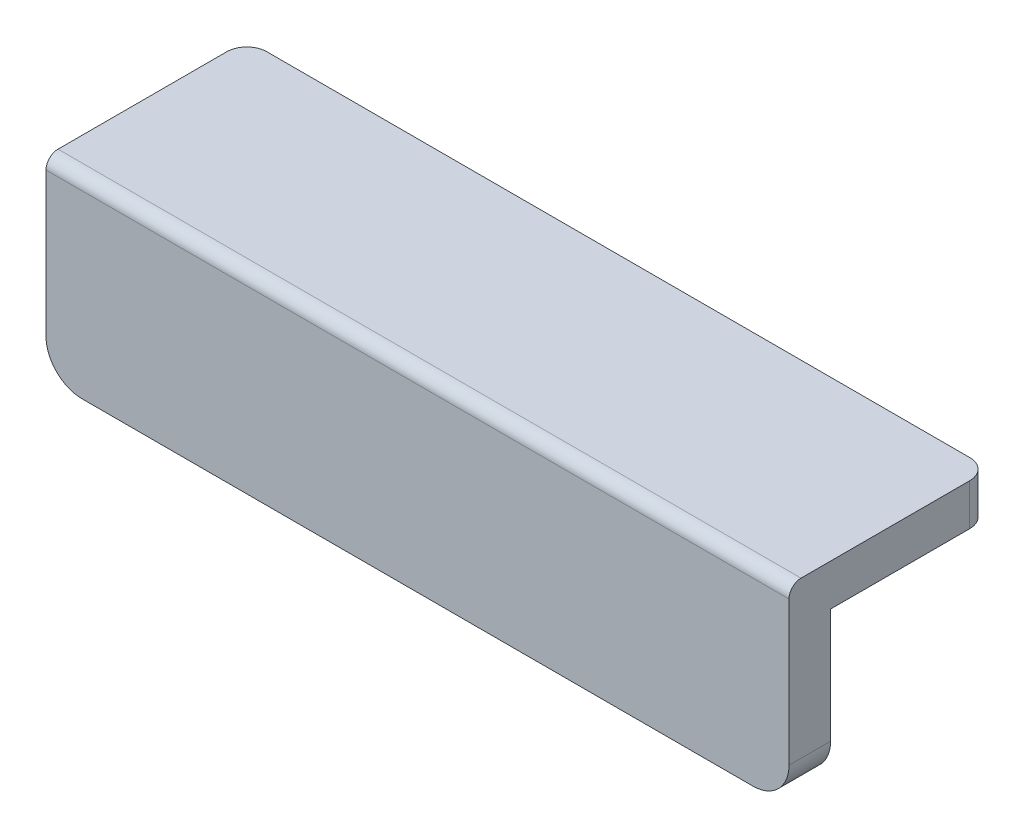
ISO-10303-21;
HEADER;
FILE_DESCRIPTION(('STEP AP214'),'2;1');
FILE_NAME('part.step','',(''),(''),'','','');
FILE_SCHEMA(('AUTOMOTIVE_DESIGN { 1 0 10303 214 1 1 1 1 }'));
ENDSEC;
DATA;
#1=APPLICATION_CONTEXT('core data for automotive mechanical design processes');
#2=APPLICATION_PROTOCOL_DEFINITION('international standard','automotive_design',2000,#1);
#3=PRODUCT_CONTEXT('',#1,'mechanical');
#4=PRODUCT('Part','Part','',(#3));
#5=PRODUCT_RELATED_PRODUCT_CATEGORY('part','',(#4));
#6=PRODUCT_DEFINITION_FORMATION('','',#4);
#7=PRODUCT_DEFINITION_CONTEXT('part definition',#1,'design');
#8=PRODUCT_DEFINITION('design','',#6,#7);
#9=PRODUCT_DEFINITION_SHAPE('','',#8);
#10=(LENGTH_UNIT() NAMED_UNIT(*) SI_UNIT(.MILLI.,.METRE.));
#11=(NAMED_UNIT(*) PLANE_ANGLE_UNIT() SI_UNIT($,.RADIAN.));
#12=(NAMED_UNIT(*) SI_UNIT($,.STERADIAN.) SOLID_ANGLE_UNIT());
#13=UNCERTAINTY_MEASURE_WITH_UNIT(LENGTH_MEASURE(1.E-05),#10,'distance_accuracy_value','');
#14=(GEOMETRIC_REPRESENTATION_CONTEXT(3) GLOBAL_UNCERTAINTY_ASSIGNED_CONTEXT((#13)) GLOBAL_UNIT_ASSIGNED_CONTEXT((#10,
#11,#12)) REPRESENTATION_CONTEXT('',''));
#15=CARTESIAN_POINT('',(0.,0.,0.));
#16=DIRECTION('',(0.,0.,1.));
#17=DIRECTION('',(1.,0.,0.));
#18=AXIS2_PLACEMENT_3D('',#15,#16,#17);
#19=CARTESIAN_POINT('',(44.45,-9.525,-20.2311));
#20=DIRECTION('',(0.,1.,0.));
#21=DIRECTION('',(0.,0.,1.));
#22=AXIS2_PLACEMENT_3D('',#19,#20,#21);
#23=CYLINDRICAL_SURFACE('',#22,2.54);
#24=DIRECTION('',(0.,1.,0.));
#25=VECTOR('',#24,1.);
#26=CARTESIAN_POINT('',(46.99,-9.525,-20.2311));
#27=LINE('',#26,#25);
#28=CARTESIAN_POINT('',(46.99,9.525,-20.2311));
#29=VERTEX_POINT('',#28);
#30=CARTESIAN_POINT('',(46.99,14.7828,-20.2311));
#31=VERTEX_POINT('',#30);
#32=EDGE_CURVE('E188',#29,#31,#27,.T.);
#33=ORIENTED_EDGE('',*,*,#32,.F.);
#34=CARTESIAN_POINT('',(44.45,9.525,-20.2311));
#35=DIRECTION('',(0.,-1.,0.));
#36=DIRECTION('',(0.,0.,-1.));
#37=AXIS2_PLACEMENT_3D('',#34,#35,#36);
#38=CIRCLE('',#37,2.54);
#39=CARTESIAN_POINT('',(44.45,9.525,-22.7711));
#40=VERTEX_POINT('',#39);
#41=EDGE_CURVE('E41',#40,#29,#38,.T.);
#42=ORIENTED_EDGE('',*,*,#41,.F.);
#43=DIRECTION('',(0.,1.,0.));
#44=VECTOR('',#43,1.);
#45=CARTESIAN_POINT('',(44.45,14.7828,-22.7711));
#46=LINE('',#45,#44);
#47=CARTESIAN_POINT('',(44.45,14.7828,-22.7711));
#48=VERTEX_POINT('',#47);
#49=EDGE_CURVE('E191',#48,#40,#46,.F.);
#50=ORIENTED_EDGE('',*,*,#49,.F.);
#51=CARTESIAN_POINT('',(44.45,14.7828,-20.2311));
#52=DIRECTION('',(0.,-1.,0.));
#53=DIRECTION('',(0.,0.,-1.));
#54=AXIS2_PLACEMENT_3D('',#51,#52,#53);
#55=CIRCLE('',#54,2.54);
#56=EDGE_CURVE('E11',#31,#48,#55,.F.);
#57=ORIENTED_EDGE('',*,*,#56,.F.);
#58=EDGE_LOOP('',(#33,#42,#50,#57));
#59=FACE_BOUND('',#58,.T.);
#60=ADVANCED_FACE('F34',(#59),#23,.T.);
#61=CARTESIAN_POINT('',(-44.45,-9.525,-20.2311));
#62=DIRECTION('',(0.,-1.,0.));
#63=DIRECTION('',(0.,0.,-1.));
#64=AXIS2_PLACEMENT_3D('',#61,#62,#63);
#65=CYLINDRICAL_SURFACE('',#64,2.54);
#66=DIRECTION('',(0.,-1.,0.));
#67=VECTOR('',#66,1.);
#68=CARTESIAN_POINT('',(-46.99,-9.525,-20.2311));
#69=LINE('',#68,#67);
#70=CARTESIAN_POINT('',(-46.99,14.7828,-20.2311));
#71=VERTEX_POINT('',#70);
#72=CARTESIAN_POINT('',(-46.99,9.525,-20.2311));
#73=VERTEX_POINT('',#72);
#74=EDGE_CURVE('E121',#71,#73,#69,.T.);
#75=ORIENTED_EDGE('',*,*,#74,.F.);
#76=CARTESIAN_POINT('',(-44.45,14.7828,-20.2311));
#77=DIRECTION('',(0.,-1.,0.));
#78=DIRECTION('',(0.,0.,-1.));
#79=AXIS2_PLACEMENT_3D('',#76,#77,#78);
#80=CIRCLE('',#79,2.54);
#81=CARTESIAN_POINT('',(-44.45,14.7828,-22.7711));
#82=VERTEX_POINT('',#81);
#83=EDGE_CURVE('E184',#82,#71,#80,.F.);
#84=ORIENTED_EDGE('',*,*,#83,.F.);
#85=DIRECTION('',(0.,-1.,0.));
#86=VECTOR('',#85,1.);
#87=CARTESIAN_POINT('',(-44.45,14.7828,-22.7711));
#88=LINE('',#87,#86);
#89=CARTESIAN_POINT('',(-44.45,9.525,-22.7711));
#90=VERTEX_POINT('',#89);
#91=EDGE_CURVE('E181',#90,#82,#88,.F.);
#92=ORIENTED_EDGE('',*,*,#91,.F.);
#93=CARTESIAN_POINT('',(-44.45,9.525,-20.2311));
#94=DIRECTION('',(0.,-1.,0.));
#95=DIRECTION('',(0.,0.,-1.));
#96=AXIS2_PLACEMENT_3D('',#93,#94,#95);
#97=CIRCLE('',#96,2.54);
#98=EDGE_CURVE('E186',#73,#90,#97,.T.);
#99=ORIENTED_EDGE('',*,*,#98,.F.);
#100=EDGE_LOOP('',(#75,#84,#92,#99));
#101=FACE_BOUND('',#100,.T.);
#102=ADVANCED_FACE('F244',(#101),#65,.T.);
#103=CARTESIAN_POINT('',(-46.99,13.2588,1.1049));
#104=DIRECTION('',(1.,0.,0.));
#105=DIRECTION('',(0.,0.,-1.));
#106=AXIS2_PLACEMENT_3D('',#103,#104,#105);
#107=CYLINDRICAL_SURFACE('',#106,1.524);
#108=DIRECTION('',(1.,0.,0.));
#109=VECTOR('',#108,1.);
#110=CARTESIAN_POINT('',(-46.99,14.7828,1.1049));
#111=LINE('',#110,#109);
#112=CARTESIAN_POINT('',(-46.99,14.7828,1.1049));
#113=VERTEX_POINT('',#112);
#114=CARTESIAN_POINT('',(46.99,14.7828,1.1049));
#115=VERTEX_POINT('',#114);
#116=EDGE_CURVE('E214',#113,#115,#111,.T.);
#117=ORIENTED_EDGE('',*,*,#116,.F.);
#118=CARTESIAN_POINT('',(-46.99,13.2588,1.1049));
#119=DIRECTION('',(1.,0.,0.));
#120=DIRECTION('',(0.,0.,-1.));
#121=AXIS2_PLACEMENT_3D('',#118,#119,#120);
#122=CIRCLE('',#121,1.524);
#123=CARTESIAN_POINT('',(-46.99,13.2588,2.6289));
#124=VERTEX_POINT('',#123);
#125=EDGE_CURVE('E218',#124,#113,#122,.F.);
#126=ORIENTED_EDGE('',*,*,#125,.F.);
#127=DIRECTION('',(1.,0.,0.));
#128=VECTOR('',#127,1.);
#129=CARTESIAN_POINT('',(46.99,13.2588,2.6289));
#130=LINE('',#129,#128);
#131=CARTESIAN_POINT('',(46.99,13.2588,2.6289));
#132=VERTEX_POINT('',#131);
#133=EDGE_CURVE('E217',#132,#124,#130,.F.);
#134=ORIENTED_EDGE('',*,*,#133,.F.);
#135=CARTESIAN_POINT('',(46.99,13.2588,1.1049));
#136=DIRECTION('',(-1.,0.,0.));
#137=DIRECTION('',(0.,0.,1.));
#138=AXIS2_PLACEMENT_3D('',#135,#136,#137);
#139=CIRCLE('',#138,1.524);
#140=EDGE_CURVE('E178',#115,#132,#139,.F.);
#141=ORIENTED_EDGE('',*,*,#140,.F.);
#142=EDGE_LOOP('',(#117,#126,#134,#141));
#143=FACE_BOUND('',#142,.T.);
#144=ADVANCED_FACE('F225',(#143),#107,.T.);
#145=CARTESIAN_POINT('',(42.418,-4.953,2.6289));
#146=DIRECTION('',(0.,0.,1.));
#147=DIRECTION('',(1.,0.,0.));
#148=AXIS2_PLACEMENT_3D('',#145,#146,#147);
#149=CYLINDRICAL_SURFACE('',#148,4.572);
#150=DIRECTION('',(0.,0.,1.));
#151=VECTOR('',#150,1.);
#152=CARTESIAN_POINT('',(42.418,-9.525,2.6289));
#153=LINE('',#152,#151);
#154=CARTESIAN_POINT('',(42.418,-9.525,-2.6289));
#155=VERTEX_POINT('',#154);
#156=CARTESIAN_POINT('',(42.418,-9.525,2.6289));
#157=VERTEX_POINT('',#156);
#158=EDGE_CURVE('E203',#155,#157,#153,.T.);
#159=ORIENTED_EDGE('',*,*,#158,.F.);
#160=CARTESIAN_POINT('',(42.418,-4.953,-2.6289));
#161=DIRECTION('',(0.,0.,-1.));
#162=DIRECTION('',(-1.,0.,0.));
#163=AXIS2_PLACEMENT_3D('',#160,#161,#162);
#164=CIRCLE('',#163,4.572);
#165=CARTESIAN_POINT('',(46.99,-4.953,-2.6289));
#166=VERTEX_POINT('',#165);
#167=EDGE_CURVE('E198',#166,#155,#164,.T.);
#168=ORIENTED_EDGE('',*,*,#167,.F.);
#169=DIRECTION('',(0.,0.,1.));
#170=VECTOR('',#169,1.);
#171=CARTESIAN_POINT('',(46.99,-4.953,2.6289));
#172=LINE('',#171,#170);
#173=CARTESIAN_POINT('',(46.99,-4.953,2.6289));
#174=VERTEX_POINT('',#173);
#175=EDGE_CURVE('E197',#174,#166,#172,.F.);
#176=ORIENTED_EDGE('',*,*,#175,.F.);
#177=CARTESIAN_POINT('',(42.418,-4.953,2.6289));
#178=DIRECTION('',(0.,0.,-1.));
#179=DIRECTION('',(-1.,0.,0.));
#180=AXIS2_PLACEMENT_3D('',#177,#178,#179);
#181=CIRCLE('',#180,4.572);
#182=EDGE_CURVE('E201',#157,#174,#181,.F.);
#183=ORIENTED_EDGE('',*,*,#182,.F.);
#184=EDGE_LOOP('',(#159,#168,#176,#183));
#185=FACE_BOUND('',#184,.T.);
#186=ADVANCED_FACE('F204',(#185),#149,.T.);
#187=CARTESIAN_POINT('',(-42.418,-4.953,2.6289));
#188=DIRECTION('',(0.,0.,-1.));
#189=DIRECTION('',(-1.,0.,0.));
#190=AXIS2_PLACEMENT_3D('',#187,#188,#189);
#191=CYLINDRICAL_SURFACE('',#190,4.572);
#192=DIRECTION('',(0.,0.,-1.));
#193=VECTOR('',#192,1.);
#194=CARTESIAN_POINT('',(-42.418,-9.525,2.6289));
#195=LINE('',#194,#193);
#196=CARTESIAN_POINT('',(-42.418,-9.525,2.6289));
#197=VERTEX_POINT('',#196);
#198=CARTESIAN_POINT('',(-42.418,-9.525,-2.6289));
#199=VERTEX_POINT('',#198);
#200=EDGE_CURVE('E230',#197,#199,#195,.T.);
#201=ORIENTED_EDGE('',*,*,#200,.F.);
#202=CARTESIAN_POINT('',(-42.418,-4.953,2.6289));
#203=DIRECTION('',(0.,0.,-1.));
#204=DIRECTION('',(-1.,0.,0.));
#205=AXIS2_PLACEMENT_3D('',#202,#203,#204);
#206=CIRCLE('',#205,4.572);
#207=CARTESIAN_POINT('',(-46.99,-4.953,2.6289));
#208=VERTEX_POINT('',#207);
#209=EDGE_CURVE('E209',#208,#197,#206,.F.);
#210=ORIENTED_EDGE('',*,*,#209,.F.);
#211=DIRECTION('',(0.,0.,-1.));
#212=VECTOR('',#211,1.);
#213=CARTESIAN_POINT('',(-46.99,-4.953,2.6289));
#214=LINE('',#213,#212);
#215=CARTESIAN_POINT('',(-46.99,-4.953,-2.6289));
#216=VERTEX_POINT('',#215);
#217=EDGE_CURVE('E228',#216,#208,#214,.F.);
#218=ORIENTED_EDGE('',*,*,#217,.F.);
#219=CARTESIAN_POINT('',(-42.418,-4.953,-2.6289));
#220=DIRECTION('',(0.,0.,-1.));
#221=DIRECTION('',(-1.,0.,0.));
#222=AXIS2_PLACEMENT_3D('',#219,#220,#221);
#223=CIRCLE('',#222,4.572);
#224=EDGE_CURVE('E134',#199,#216,#223,.T.);
#225=ORIENTED_EDGE('',*,*,#224,.F.);
#226=EDGE_LOOP('',(#201,#210,#218,#225));
#227=FACE_BOUND('',#226,.T.);
#228=ADVANCED_FACE('F256',(#227),#191,.T.);
#229=CARTESIAN_POINT('',(46.99,-9.525,2.6289));
#230=DIRECTION('',(-1.,0.,0.));
#231=DIRECTION('',(0.,0.,1.));
#232=AXIS2_PLACEMENT_3D('',#229,#230,#231);
#233=PLANE('',#232);
#234=DIRECTION('',(0.,0.,-1.));
#235=VECTOR('',#234,1.);
#236=CARTESIAN_POINT('',(46.99,9.525,2.6289));
#237=LINE('',#236,#235);
#238=CARTESIAN_POINT('',(46.99,9.525,-2.6289));
#239=VERTEX_POINT('',#238);
#240=EDGE_CURVE('E125',#239,#29,#237,.T.);
#241=ORIENTED_EDGE('',*,*,#240,.T.);
#242=ORIENTED_EDGE('',*,*,#32,.T.);
#243=DIRECTION('',(0.,0.,-1.));
#244=VECTOR('',#243,1.);
#245=CARTESIAN_POINT('',(46.99,14.7828,2.6289));
#246=LINE('',#245,#244);
#247=EDGE_CURVE('E223',#115,#31,#246,.T.);
#248=ORIENTED_EDGE('',*,*,#247,.F.);
#249=ORIENTED_EDGE('',*,*,#140,.T.);
#250=DIRECTION('',(0.,1.,0.));
#251=VECTOR('',#250,1.);
#252=CARTESIAN_POINT('',(46.99,-9.525,2.6289));
#253=LINE('',#252,#251);
#254=EDGE_CURVE('E157',#174,#132,#253,.T.);
#255=ORIENTED_EDGE('',*,*,#254,.F.);
#256=ORIENTED_EDGE('',*,*,#175,.T.);
#257=DIRECTION('',(0.,1.,0.));
#258=VECTOR('',#257,1.);
#259=CARTESIAN_POINT('',(46.99,-9.525,-2.6289));
#260=LINE('',#259,#258);
#261=EDGE_CURVE('E141',#166,#239,#260,.T.);
#262=ORIENTED_EDGE('',*,*,#261,.T.);
#263=EDGE_LOOP('',(#241,#242,#248,#249,#255,#256,#262));
#264=FACE_BOUND('',#263,.T.);
#265=ADVANCED_FACE('F194',(#264),#233,.F.);
#266=CARTESIAN_POINT('',(-46.99,-9.525,2.6289));
#267=DIRECTION('',(1.,0.,0.));
#268=DIRECTION('',(0.,0.,-1.));
#269=AXIS2_PLACEMENT_3D('',#266,#267,#268);
#270=PLANE('',#269);
#271=DIRECTION('',(0.,0.,1.));
#272=VECTOR('',#271,1.);
#273=CARTESIAN_POINT('',(-46.99,14.7828,2.6289));
#274=LINE('',#273,#272);
#275=EDGE_CURVE('E352',#71,#113,#274,.T.);
#276=ORIENTED_EDGE('',*,*,#275,.F.);
#277=ORIENTED_EDGE('',*,*,#74,.T.);
#278=DIRECTION('',(0.,0.,1.));
#279=VECTOR('',#278,1.);
#280=CARTESIAN_POINT('',(-46.99,9.525,2.6289));
#281=LINE('',#280,#279);
#282=CARTESIAN_POINT('',(-46.99,9.525,-2.6289));
#283=VERTEX_POINT('',#282);
#284=EDGE_CURVE('E114',#73,#283,#281,.T.);
#285=ORIENTED_EDGE('',*,*,#284,.T.);
#286=DIRECTION('',(0.,-1.,0.));
#287=VECTOR('',#286,1.);
#288=CARTESIAN_POINT('',(-46.99,-9.525,-2.6289));
#289=LINE('',#288,#287);
#290=EDGE_CURVE('E119',#283,#216,#289,.T.);
#291=ORIENTED_EDGE('',*,*,#290,.T.);
#292=ORIENTED_EDGE('',*,*,#217,.T.);
#293=DIRECTION('',(0.,-1.,0.));
#294=VECTOR('',#293,1.);
#295=CARTESIAN_POINT('',(-46.99,-9.525,2.6289));
#296=LINE('',#295,#294);
#297=EDGE_CURVE('E162',#124,#208,#296,.T.);
#298=ORIENTED_EDGE('',*,*,#297,.F.);
#299=ORIENTED_EDGE('',*,*,#125,.T.);
#300=EDGE_LOOP('',(#276,#277,#285,#291,#292,#298,#299));
#301=FACE_BOUND('',#300,.T.);
#302=ADVANCED_FACE('F117',(#301),#270,.F.);
#303=CARTESIAN_POINT('',(-46.99,-9.525,2.6289));
#304=DIRECTION('',(0.,1.,0.));
#305=DIRECTION('',(0.,0.,1.));
#306=AXIS2_PLACEMENT_3D('',#303,#304,#305);
#307=PLANE('',#306);
#308=DIRECTION('',(1.,0.,0.));
#309=VECTOR('',#308,1.);
#310=CARTESIAN_POINT('',(-46.99,-9.525,-2.6289));
#311=LINE('',#310,#309);
#312=EDGE_CURVE('E136',#199,#155,#311,.T.);
#313=ORIENTED_EDGE('',*,*,#312,.T.);
#314=ORIENTED_EDGE('',*,*,#158,.T.);
#315=DIRECTION('',(1.,0.,0.));
#316=VECTOR('',#315,1.);
#317=CARTESIAN_POINT('',(-46.99,-9.525,2.6289));
#318=LINE('',#317,#316);
#319=EDGE_CURVE('E154',#197,#157,#318,.T.);
#320=ORIENTED_EDGE('',*,*,#319,.F.);
#321=ORIENTED_EDGE('',*,*,#200,.T.);
#322=EDGE_LOOP('',(#313,#314,#320,#321));
#323=FACE_BOUND('',#322,.T.);
#324=ADVANCED_FACE('F233',(#323),#307,.F.);
#325=CARTESIAN_POINT('',(46.99,9.525,2.6289));
#326=DIRECTION('',(0.,0.,-1.));
#327=DIRECTION('',(-1.,0.,0.));
#328=AXIS2_PLACEMENT_3D('',#325,#326,#327);
#329=PLANE('',#328);
#330=ORIENTED_EDGE('',*,*,#254,.T.);
#331=ORIENTED_EDGE('',*,*,#133,.T.);
#332=ORIENTED_EDGE('',*,*,#297,.T.);
#333=ORIENTED_EDGE('',*,*,#209,.T.);
#334=ORIENTED_EDGE('',*,*,#319,.T.);
#335=ORIENTED_EDGE('',*,*,#182,.T.);
#336=EDGE_LOOP('',(#330,#331,#332,#333,#334,#335));
#337=FACE_BOUND('',#336,.T.);
#338=ADVANCED_FACE('F226',(#337),#329,.F.);
#339=CARTESIAN_POINT('',(46.99,9.525,-2.6289));
#340=DIRECTION('',(0.,0.,-1.));
#341=DIRECTION('',(-1.,0.,0.));
#342=AXIS2_PLACEMENT_3D('',#339,#340,#341);
#343=PLANE('',#342);
#344=ORIENTED_EDGE('',*,*,#261,.F.);
#345=ORIENTED_EDGE('',*,*,#167,.T.);
#346=ORIENTED_EDGE('',*,*,#312,.F.);
#347=ORIENTED_EDGE('',*,*,#224,.T.);
#348=ORIENTED_EDGE('',*,*,#290,.F.);
#349=DIRECTION('',(-1.,0.,0.));
#350=VECTOR('',#349,1.);
#351=CARTESIAN_POINT('',(-46.99,9.525,-2.6289));
#352=LINE('',#351,#350);
#353=EDGE_CURVE('E131',#239,#283,#352,.T.);
#354=ORIENTED_EDGE('',*,*,#353,.F.);
#355=EDGE_LOOP('',(#344,#345,#346,#347,#348,#354));
#356=FACE_BOUND('',#355,.T.);
#357=ADVANCED_FACE('F130',(#356),#343,.T.);
#358=CARTESIAN_POINT('',(-46.99,14.7828,-22.7711));
#359=DIRECTION('',(0.,0.,1.));
#360=DIRECTION('',(1.,0.,0.));
#361=AXIS2_PLACEMENT_3D('',#358,#359,#360);
#362=PLANE('',#361);
#363=DIRECTION('',(-1.,0.,0.));
#364=VECTOR('',#363,1.);
#365=CARTESIAN_POINT('',(-46.99,14.7828,-22.7711));
#366=LINE('',#365,#364);
#367=EDGE_CURVE('E143',#48,#82,#366,.T.);
#368=ORIENTED_EDGE('',*,*,#367,.F.);
#369=ORIENTED_EDGE('',*,*,#49,.T.);
#370=DIRECTION('',(-1.,0.,0.));
#371=VECTOR('',#370,1.);
#372=CARTESIAN_POINT('',(-46.99,9.525,-22.7711));
#373=LINE('',#372,#371);
#374=EDGE_CURVE('E170',#40,#90,#373,.T.);
#375=ORIENTED_EDGE('',*,*,#374,.T.);
#376=ORIENTED_EDGE('',*,*,#91,.T.);
#377=EDGE_LOOP('',(#368,#369,#375,#376));
#378=FACE_BOUND('',#377,.T.);
#379=ADVANCED_FACE('F313',(#378),#362,.F.);
#380=CARTESIAN_POINT('',(-46.99,14.7828,-22.7711));
#381=DIRECTION('',(0.,-1.,0.));
#382=DIRECTION('',(0.,0.,-1.));
#383=AXIS2_PLACEMENT_3D('',#380,#381,#382);
#384=PLANE('',#383);
#385=ORIENTED_EDGE('',*,*,#247,.T.);
#386=ORIENTED_EDGE('',*,*,#56,.T.);
#387=ORIENTED_EDGE('',*,*,#367,.T.);
#388=ORIENTED_EDGE('',*,*,#83,.T.);
#389=ORIENTED_EDGE('',*,*,#275,.T.);
#390=ORIENTED_EDGE('',*,*,#116,.T.);
#391=EDGE_LOOP('',(#385,#386,#387,#388,#389,#390));
#392=FACE_BOUND('',#391,.T.);
#393=ADVANCED_FACE('F305',(#392),#384,.F.);
#394=CARTESIAN_POINT('',(-46.99,9.525,-22.7711));
#395=DIRECTION('',(0.,-1.,0.));
#396=DIRECTION('',(0.,0.,-1.));
#397=AXIS2_PLACEMENT_3D('',#394,#395,#396);
#398=PLANE('',#397);
#399=ORIENTED_EDGE('',*,*,#374,.F.);
#400=ORIENTED_EDGE('',*,*,#41,.T.);
#401=ORIENTED_EDGE('',*,*,#240,.F.);
#402=ORIENTED_EDGE('',*,*,#353,.T.);
#403=ORIENTED_EDGE('',*,*,#284,.F.);
#404=ORIENTED_EDGE('',*,*,#98,.T.);
#405=EDGE_LOOP('',(#399,#400,#401,#402,#403,#404));
#406=FACE_BOUND('',#405,.T.);
#407=ADVANCED_FACE('F139',(#406),#398,.T.);
#408=CLOSED_SHELL('',(#60,#102,#144,#186,#228,#265,#302,#324,#338,#357,#379,#393,#407));
#409=MANIFOLD_SOLID_BREP('B2',#408);
#410=ADVANCED_BREP_SHAPE_REPRESENTATION('',(#18,#409),#14);
#411=SHAPE_DEFINITION_REPRESENTATION(#9,#410);
ENDSEC;
END-ISO-10303-21;
